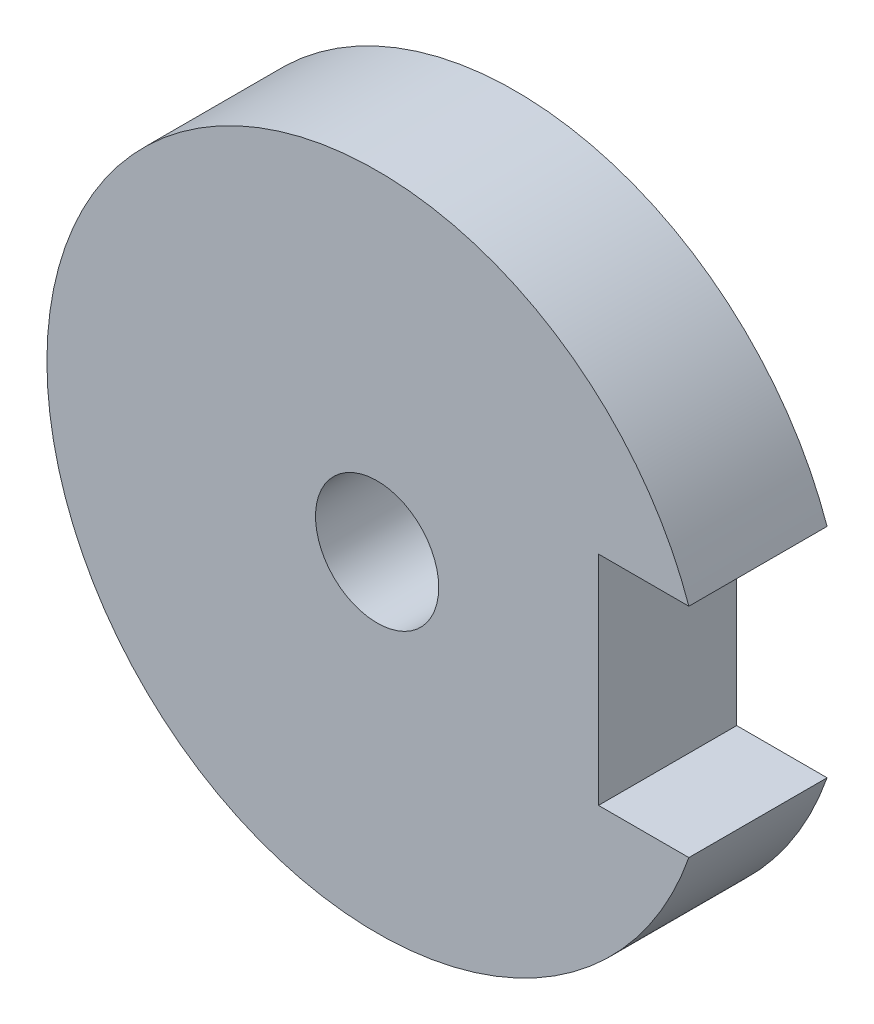
ISO-10303-21;
HEADER;
FILE_DESCRIPTION(('STEP AP214'),'2;1');
FILE_NAME('part.step','',(''),(''),'','','');
FILE_SCHEMA(('AUTOMOTIVE_DESIGN { 1 0 10303 214 1 1 1 1 }'));
ENDSEC;
DATA;
#1=APPLICATION_CONTEXT('core data for automotive mechanical design processes');
#2=APPLICATION_PROTOCOL_DEFINITION('international standard','automotive_design',2000,#1);
#3=PRODUCT_CONTEXT('',#1,'mechanical');
#4=PRODUCT('Part','Part','',(#3));
#5=PRODUCT_RELATED_PRODUCT_CATEGORY('part','',(#4));
#6=PRODUCT_DEFINITION_FORMATION('','',#4);
#7=PRODUCT_DEFINITION_CONTEXT('part definition',#1,'design');
#8=PRODUCT_DEFINITION('design','',#6,#7);
#9=PRODUCT_DEFINITION_SHAPE('','',#8);
#10=(LENGTH_UNIT() NAMED_UNIT(*) SI_UNIT(.MILLI.,.METRE.));
#11=(NAMED_UNIT(*) PLANE_ANGLE_UNIT() SI_UNIT($,.RADIAN.));
#12=(NAMED_UNIT(*) SI_UNIT($,.STERADIAN.) SOLID_ANGLE_UNIT());
#13=UNCERTAINTY_MEASURE_WITH_UNIT(LENGTH_MEASURE(1.E-05),#10,'distance_accuracy_value','');
#14=(GEOMETRIC_REPRESENTATION_CONTEXT(3) GLOBAL_UNCERTAINTY_ASSIGNED_CONTEXT((#13)) GLOBAL_UNIT_ASSIGNED_CONTEXT((#10,
#11,#12)) REPRESENTATION_CONTEXT('',''));
#15=CARTESIAN_POINT('',(0.,0.,0.));
#16=DIRECTION('',(0.,0.,1.));
#17=DIRECTION('',(1.,0.,0.));
#18=AXIS2_PLACEMENT_3D('',#15,#16,#17);
#19=CARTESIAN_POINT('',(0.,0.,3.175));
#20=DIRECTION('',(0.,0.,1.));
#21=DIRECTION('',(1.,0.,0.));
#22=AXIS2_PLACEMENT_3D('',#19,#20,#21);
#23=PLANE('',#22);
#24=DIRECTION('',(1.,0.,0.));
#25=VECTOR('',#24,1.);
#26=CARTESIAN_POINT('',(5.085,-2.5,3.175));
#27=LINE('',#26,#25);
#28=CARTESIAN_POINT('',(5.085,-2.5,3.175));
#29=VERTEX_POINT('',#28);
#30=CARTESIAN_POINT('',(7.16116086957974,-2.5,3.175));
#31=VERTEX_POINT('',#30);
#32=EDGE_CURVE('E106',#29,#31,#27,.T.);
#33=ORIENTED_EDGE('',*,*,#32,.F.);
#34=DIRECTION('',(0.,-1.,0.));
#35=VECTOR('',#34,1.);
#36=CARTESIAN_POINT('',(5.085,-2.5,3.175));
#37=LINE('',#36,#35);
#38=CARTESIAN_POINT('',(5.085,2.5,3.175));
#39=VERTEX_POINT('',#38);
#40=EDGE_CURVE('E103',#39,#29,#37,.T.);
#41=ORIENTED_EDGE('',*,*,#40,.F.);
#42=DIRECTION('',(-1.,0.,0.));
#43=VECTOR('',#42,1.);
#44=CARTESIAN_POINT('',(5.085,2.5,3.175));
#45=LINE('',#44,#43);
#46=CARTESIAN_POINT('',(7.16116086957974,2.5,3.175));
#47=VERTEX_POINT('',#46);
#48=EDGE_CURVE('E81',#47,#39,#45,.T.);
#49=ORIENTED_EDGE('',*,*,#48,.F.);
#50=CARTESIAN_POINT('',(0.,0.,3.175));
#51=DIRECTION('',(0.,0.,1.));
#52=DIRECTION('',(1.,0.,0.));
#53=AXIS2_PLACEMENT_3D('',#50,#51,#52);
#54=CIRCLE('',#53,7.585);
#55=EDGE_CURVE('E123',#47,#31,#54,.T.);
#56=ORIENTED_EDGE('',*,*,#55,.T.);
#57=EDGE_LOOP('',(#33,#41,#49,#56));
#58=FACE_BOUND('',#57,.T.);
#59=CARTESIAN_POINT('',(0.,0.,3.175));
#60=DIRECTION('',(0.,0.,1.));
#61=DIRECTION('',(1.,0.,0.));
#62=AXIS2_PLACEMENT_3D('',#59,#60,#61);
#63=CIRCLE('',#62,1.415);
#64=CARTESIAN_POINT('',(1.415,0.,3.175));
#65=VERTEX_POINT('',#64);
#66=EDGE_CURVE('E116',#65,#65,#63,.T.);
#67=ORIENTED_EDGE('',*,*,#66,.F.);
#68=EDGE_LOOP('',(#67));
#69=FACE_BOUND('',#68,.T.);
#70=ADVANCED_FACE('F38',(#58,#69),#23,.T.);
#71=CARTESIAN_POINT('',(0.,0.,0.));
#72=DIRECTION('',(0.,0.,1.));
#73=DIRECTION('',(1.,0.,0.));
#74=AXIS2_PLACEMENT_3D('',#71,#72,#73);
#75=PLANE('',#74);
#76=DIRECTION('',(0.,-1.,0.));
#77=VECTOR('',#76,1.);
#78=CARTESIAN_POINT('',(5.085,-2.5,0.));
#79=LINE('',#78,#77);
#80=CARTESIAN_POINT('',(5.085,2.5,0.));
#81=VERTEX_POINT('',#80);
#82=CARTESIAN_POINT('',(5.085,-2.5,0.));
#83=VERTEX_POINT('',#82);
#84=EDGE_CURVE('E87',#81,#83,#79,.T.);
#85=ORIENTED_EDGE('',*,*,#84,.T.);
#86=DIRECTION('',(1.,0.,0.));
#87=VECTOR('',#86,1.);
#88=CARTESIAN_POINT('',(5.085,-2.5,0.));
#89=LINE('',#88,#87);
#90=CARTESIAN_POINT('',(7.16116086957974,-2.5,0.));
#91=VERTEX_POINT('',#90);
#92=EDGE_CURVE('E100',#83,#91,#89,.T.);
#93=ORIENTED_EDGE('',*,*,#92,.T.);
#94=CARTESIAN_POINT('',(0.,0.,0.));
#95=DIRECTION('',(0.,0.,1.));
#96=DIRECTION('',(1.,0.,0.));
#97=AXIS2_PLACEMENT_3D('',#94,#95,#96);
#98=CIRCLE('',#97,7.585);
#99=CARTESIAN_POINT('',(7.16116086957974,2.5,0.));
#100=VERTEX_POINT('',#99);
#101=EDGE_CURVE('E98',#100,#91,#98,.T.);
#102=ORIENTED_EDGE('',*,*,#101,.F.);
#103=DIRECTION('',(-1.,0.,0.));
#104=VECTOR('',#103,1.);
#105=CARTESIAN_POINT('',(5.085,2.5,0.));
#106=LINE('',#105,#104);
#107=EDGE_CURVE('E54',#100,#81,#106,.T.);
#108=ORIENTED_EDGE('',*,*,#107,.T.);
#109=EDGE_LOOP('',(#85,#93,#102,#108));
#110=FACE_BOUND('',#109,.T.);
#111=CARTESIAN_POINT('',(0.,0.,0.));
#112=DIRECTION('',(0.,0.,1.));
#113=DIRECTION('',(1.,0.,0.));
#114=AXIS2_PLACEMENT_3D('',#111,#112,#113);
#115=CIRCLE('',#114,1.415);
#116=CARTESIAN_POINT('',(1.415,0.,0.));
#117=VERTEX_POINT('',#116);
#118=EDGE_CURVE('E114',#117,#117,#115,.T.);
#119=ORIENTED_EDGE('',*,*,#118,.T.);
#120=EDGE_LOOP('',(#119));
#121=FACE_BOUND('',#120,.T.);
#122=ADVANCED_FACE('F95',(#110,#121),#75,.F.);
#123=CARTESIAN_POINT('',(0.,0.,3.175));
#124=DIRECTION('',(0.,0.,-1.));
#125=DIRECTION('',(-1.,0.,0.));
#126=AXIS2_PLACEMENT_3D('',#123,#124,#125);
#127=CYLINDRICAL_SURFACE('',#126,7.585);
#128=ORIENTED_EDGE('',*,*,#101,.T.);
#129=DIRECTION('',(0.,0.,-1.));
#130=VECTOR('',#129,1.);
#131=CARTESIAN_POINT('',(7.16116086957974,-2.5,3.175));
#132=LINE('',#131,#130);
#133=EDGE_CURVE('E11',#91,#31,#132,.F.);
#134=ORIENTED_EDGE('',*,*,#133,.T.);
#135=ORIENTED_EDGE('',*,*,#55,.F.);
#136=DIRECTION('',(0.,0.,-1.));
#137=VECTOR('',#136,1.);
#138=CARTESIAN_POINT('',(7.16116086957974,2.5,3.175));
#139=LINE('',#138,#137);
#140=EDGE_CURVE('E47',#47,#100,#139,.T.);
#141=ORIENTED_EDGE('',*,*,#140,.T.);
#142=EDGE_LOOP('',(#128,#134,#135,#141));
#143=FACE_BOUND('',#142,.T.);
#144=ADVANCED_FACE('F40',(#143),#127,.T.);
#145=CARTESIAN_POINT('',(0.,0.,3.175));
#146=DIRECTION('',(0.,0.,-1.));
#147=DIRECTION('',(-1.,0.,0.));
#148=AXIS2_PLACEMENT_3D('',#145,#146,#147);
#149=CYLINDRICAL_SURFACE('',#148,1.415);
#150=ORIENTED_EDGE('',*,*,#66,.T.);
#151=EDGE_LOOP('',(#150));
#152=FACE_BOUND('',#151,.T.);
#153=ORIENTED_EDGE('',*,*,#118,.F.);
#154=EDGE_LOOP('',(#153));
#155=FACE_BOUND('',#154,.T.);
#156=ADVANCED_FACE('F136',(#152,#155),#149,.F.);
#157=CARTESIAN_POINT('',(5.085,-2.5,0.));
#158=DIRECTION('',(0.,-1.,0.));
#159=DIRECTION('',(0.,0.,-1.));
#160=AXIS2_PLACEMENT_3D('',#157,#158,#159);
#161=PLANE('',#160);
#162=ORIENTED_EDGE('',*,*,#92,.F.);
#163=DIRECTION('',(0.,0.,1.));
#164=VECTOR('',#163,1.);
#165=CARTESIAN_POINT('',(5.085,-2.5,0.));
#166=LINE('',#165,#164);
#167=EDGE_CURVE('E86',#83,#29,#166,.T.);
#168=ORIENTED_EDGE('',*,*,#167,.T.);
#169=ORIENTED_EDGE('',*,*,#32,.T.);
#170=ORIENTED_EDGE('',*,*,#133,.F.);
#171=EDGE_LOOP('',(#162,#168,#169,#170));
#172=FACE_BOUND('',#171,.T.);
#173=ADVANCED_FACE('F134',(#172),#161,.F.);
#174=CARTESIAN_POINT('',(5.085,2.5,0.));
#175=DIRECTION('',(0.,1.,0.));
#176=DIRECTION('',(0.,0.,1.));
#177=AXIS2_PLACEMENT_3D('',#174,#175,#176);
#178=PLANE('',#177);
#179=ORIENTED_EDGE('',*,*,#48,.T.);
#180=DIRECTION('',(0.,0.,1.));
#181=VECTOR('',#180,1.);
#182=CARTESIAN_POINT('',(5.085,2.5,0.));
#183=LINE('',#182,#181);
#184=EDGE_CURVE('E77',#81,#39,#183,.T.);
#185=ORIENTED_EDGE('',*,*,#184,.F.);
#186=ORIENTED_EDGE('',*,*,#107,.F.);
#187=ORIENTED_EDGE('',*,*,#140,.F.);
#188=EDGE_LOOP('',(#179,#185,#186,#187));
#189=FACE_BOUND('',#188,.T.);
#190=ADVANCED_FACE('F79',(#189),#178,.F.);
#191=CARTESIAN_POINT('',(5.085,-2.5,0.));
#192=DIRECTION('',(-1.,0.,0.));
#193=DIRECTION('',(0.,0.,1.));
#194=AXIS2_PLACEMENT_3D('',#191,#192,#193);
#195=PLANE('',#194);
#196=ORIENTED_EDGE('',*,*,#40,.T.);
#197=ORIENTED_EDGE('',*,*,#167,.F.);
#198=ORIENTED_EDGE('',*,*,#84,.F.);
#199=ORIENTED_EDGE('',*,*,#184,.T.);
#200=EDGE_LOOP('',(#196,#197,#198,#199));
#201=FACE_BOUND('',#200,.T.);
#202=ADVANCED_FACE('F90',(#201),#195,.F.);
#203=CLOSED_SHELL('',(#70,#122,#144,#156,#173,#190,#202));
#204=MANIFOLD_SOLID_BREP('B2',#203);
#205=ADVANCED_BREP_SHAPE_REPRESENTATION('',(#18,#204),#14);
#206=SHAPE_DEFINITION_REPRESENTATION(#9,#205);
ENDSEC;
END-ISO-10303-21;
